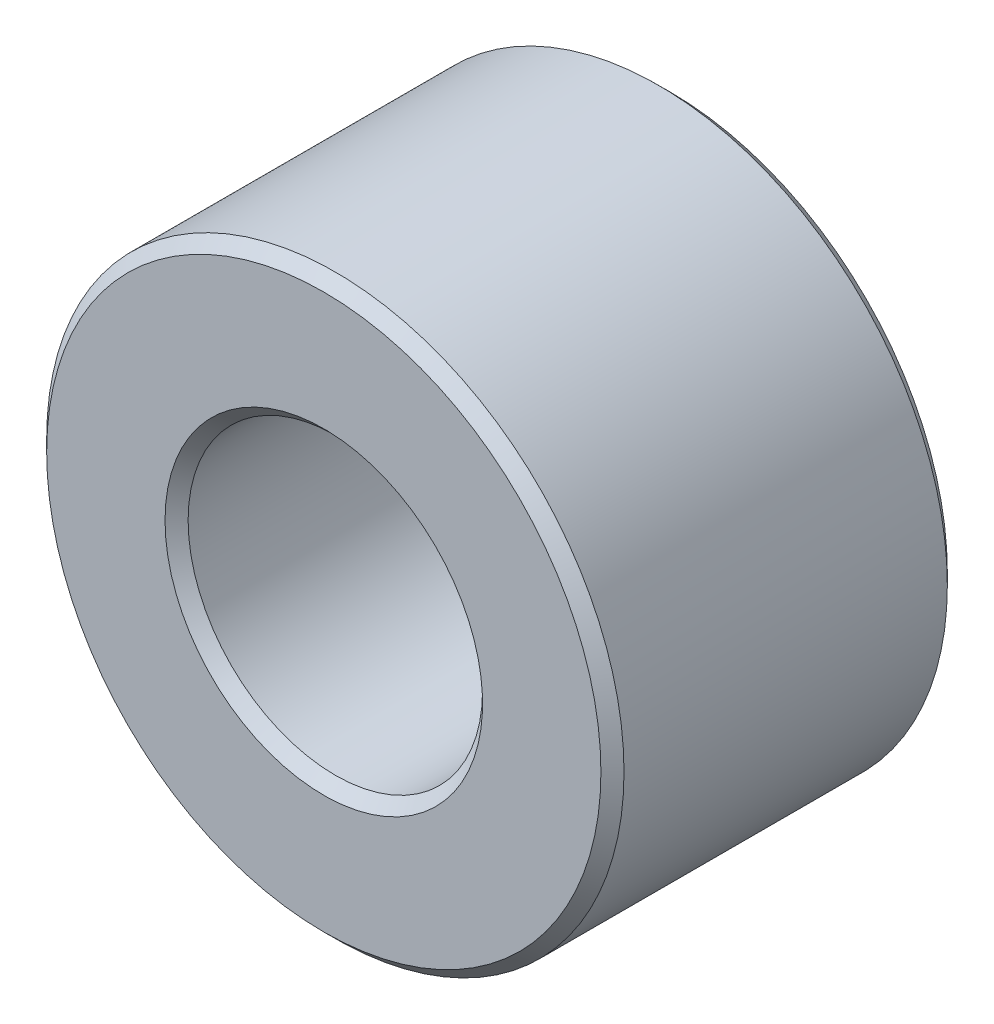
ISO-10303-21;
HEADER;
FILE_DESCRIPTION(('STEP AP214'),'2;1');
FILE_NAME('part.step','',(''),(''),'','','');
FILE_SCHEMA(('AUTOMOTIVE_DESIGN { 1 0 10303 214 1 1 1 1 }'));
ENDSEC;
DATA;
#1=APPLICATION_CONTEXT('core data for automotive mechanical design processes');
#2=APPLICATION_PROTOCOL_DEFINITION('international standard','automotive_design',2000,#1);
#3=PRODUCT_CONTEXT('',#1,'mechanical');
#4=PRODUCT('Part','Part','',(#3));
#5=PRODUCT_RELATED_PRODUCT_CATEGORY('part','',(#4));
#6=PRODUCT_DEFINITION_FORMATION('','',#4);
#7=PRODUCT_DEFINITION_CONTEXT('part definition',#1,'design');
#8=PRODUCT_DEFINITION('design','',#6,#7);
#9=PRODUCT_DEFINITION_SHAPE('','',#8);
#10=(LENGTH_UNIT() NAMED_UNIT(*) SI_UNIT(.MILLI.,.METRE.));
#11=(NAMED_UNIT(*) PLANE_ANGLE_UNIT() SI_UNIT($,.RADIAN.));
#12=(NAMED_UNIT(*) SI_UNIT($,.STERADIAN.) SOLID_ANGLE_UNIT());
#13=UNCERTAINTY_MEASURE_WITH_UNIT(LENGTH_MEASURE(1.E-05),#10,'distance_accuracy_value','');
#14=(GEOMETRIC_REPRESENTATION_CONTEXT(3) GLOBAL_UNCERTAINTY_ASSIGNED_CONTEXT((#13)) GLOBAL_UNIT_ASSIGNED_CONTEXT((#10,
#11,#12)) REPRESENTATION_CONTEXT('',''));
#15=CARTESIAN_POINT('',(0.,0.,0.));
#16=DIRECTION('',(0.,0.,1.));
#17=DIRECTION('',(1.,0.,0.));
#18=AXIS2_PLACEMENT_3D('',#15,#16,#17);
#19=CARTESIAN_POINT('',(4.79999999993197,0.,5.99999999997181));
#20=DIRECTION('',(0.,0.,1.));
#21=DIRECTION('',(1.,0.,0.));
#22=AXIS2_PLACEMENT_3D('',#19,#20,#21);
#23=PLANE('',#22);
#24=CARTESIAN_POINT('',(0.,0.,5.99999999997181));
#25=DIRECTION('',(0.,0.,-1.));
#26=DIRECTION('',(-1.,0.,0.));
#27=AXIS2_PLACEMENT_3D('',#24,#25,#26);
#28=CIRCLE('',#27,2.74999999993497);
#29=CARTESIAN_POINT('',(-2.74999999993497,0.,5.99999999997181));
#30=VERTEX_POINT('',#29);
#31=EDGE_CURVE('E12',#30,#30,#28,.T.);
#32=ORIENTED_EDGE('',*,*,#31,.T.);
#33=EDGE_LOOP('',(#32));
#34=FACE_BOUND('',#33,.T.);
#35=CARTESIAN_POINT('',(0.,0.,5.99999999997181));
#36=DIRECTION('',(0.,0.,-1.));
#37=DIRECTION('',(-1.,0.,0.));
#38=AXIS2_PLACEMENT_3D('',#35,#36,#37);
#39=CIRCLE('',#38,4.79999999993197);
#40=CARTESIAN_POINT('',(-4.79999999993197,0.,5.99999999997181));
#41=VERTEX_POINT('',#40);
#42=EDGE_CURVE('E68',#41,#41,#39,.T.);
#43=ORIENTED_EDGE('',*,*,#42,.F.);
#44=EDGE_LOOP('',(#43));
#45=FACE_BOUND('',#44,.T.);
#46=ADVANCED_FACE('F40',(#34,#45),#23,.T.);
#47=CARTESIAN_POINT('',(0.,0.,5.99999999997181));
#48=DIRECTION('',(0.,0.,1.));
#49=DIRECTION('',(1.,0.,0.));
#50=AXIS2_PLACEMENT_3D('',#47,#48,#49);
#51=CONICAL_SURFACE('',#50,2.74999999993497,0.785398163397447);
#52=CARTESIAN_POINT('',(0.,0.,5.80000000002201));
#53=DIRECTION('',(0.,0.,-1.));
#54=DIRECTION('',(-1.,0.,0.));
#55=AXIS2_PLACEMENT_3D('',#52,#53,#54);
#56=CIRCLE('',#55,2.54999999998518);
#57=CARTESIAN_POINT('',(-2.54999999998518,0.,5.80000000002201));
#58=VERTEX_POINT('',#57);
#59=EDGE_CURVE('E46',#58,#58,#56,.T.);
#60=ORIENTED_EDGE('',*,*,#59,.T.);
#61=EDGE_LOOP('',(#60));
#62=FACE_BOUND('',#61,.T.);
#63=ORIENTED_EDGE('',*,*,#31,.F.);
#64=EDGE_LOOP('',(#63));
#65=FACE_BOUND('',#64,.T.);
#66=ADVANCED_FACE('F76',(#62,#65),#51,.F.);
#67=CARTESIAN_POINT('',(0.,0.,5.99999999997181));
#68=DIRECTION('',(0.,0.,-1.));
#69=DIRECTION('',(-1.,0.,0.));
#70=AXIS2_PLACEMENT_3D('',#67,#68,#69);
#71=CYLINDRICAL_SURFACE('',#70,2.54999999998518);
#72=CARTESIAN_POINT('',(0.,0.,0.200000000006639));
#73=DIRECTION('',(0.,0.,-1.));
#74=DIRECTION('',(-1.,0.,0.));
#75=AXIS2_PLACEMENT_3D('',#72,#73,#74);
#76=CIRCLE('',#75,2.54999999998518);
#77=CARTESIAN_POINT('',(-2.54999999998518,0.,0.200000000006639));
#78=VERTEX_POINT('',#77);
#79=EDGE_CURVE('E50',#78,#78,#76,.T.);
#80=ORIENTED_EDGE('',*,*,#79,.T.);
#81=EDGE_LOOP('',(#80));
#82=FACE_BOUND('',#81,.T.);
#83=ORIENTED_EDGE('',*,*,#59,.F.);
#84=EDGE_LOOP('',(#83));
#85=FACE_BOUND('',#84,.T.);
#86=ADVANCED_FACE('F80',(#82,#85),#71,.F.);
#87=CARTESIAN_POINT('',(0.,0.,0.200000000006639));
#88=DIRECTION('',(0.,0.,-1.));
#89=DIRECTION('',(-1.,0.,0.));
#90=AXIS2_PLACEMENT_3D('',#87,#88,#89);
#91=CONICAL_SURFACE('',#90,2.54999999998518,0.785398163397448);
#92=CARTESIAN_POINT('',(0.,0.,5.6843418860808E-11));
#93=DIRECTION('',(0.,0.,-1.));
#94=DIRECTION('',(-1.,0.,0.));
#95=AXIS2_PLACEMENT_3D('',#92,#93,#94);
#96=CIRCLE('',#95,2.74999999993497);
#97=CARTESIAN_POINT('',(-2.74999999993497,0.,5.6843418860808E-11));
#98=VERTEX_POINT('',#97);
#99=EDGE_CURVE('E54',#98,#98,#96,.T.);
#100=ORIENTED_EDGE('',*,*,#99,.T.);
#101=EDGE_LOOP('',(#100));
#102=FACE_BOUND('',#101,.T.);
#103=ORIENTED_EDGE('',*,*,#79,.F.);
#104=EDGE_LOOP('',(#103));
#105=FACE_BOUND('',#104,.T.);
#106=ADVANCED_FACE('F84',(#102,#105),#91,.F.);
#107=CARTESIAN_POINT('',(2.74999999993497,0.,5.6843418860808E-11));
#108=DIRECTION('',(0.,0.,-1.));
#109=DIRECTION('',(-1.,0.,0.));
#110=AXIS2_PLACEMENT_3D('',#107,#108,#109);
#111=PLANE('',#110);
#112=CARTESIAN_POINT('',(0.,0.,5.6843418860808E-11));
#113=DIRECTION('',(0.,0.,-1.));
#114=DIRECTION('',(-1.,0.,0.));
#115=AXIS2_PLACEMENT_3D('',#112,#113,#114);
#116=CIRCLE('',#115,4.79999999998881);
#117=CARTESIAN_POINT('',(-4.79999999998881,0.,5.6843418860808E-11));
#118=VERTEX_POINT('',#117);
#119=EDGE_CURVE('E59',#118,#118,#116,.T.);
#120=ORIENTED_EDGE('',*,*,#119,.T.);
#121=EDGE_LOOP('',(#120));
#122=FACE_BOUND('',#121,.T.);
#123=ORIENTED_EDGE('',*,*,#99,.F.);
#124=EDGE_LOOP('',(#123));
#125=FACE_BOUND('',#124,.T.);
#126=ADVANCED_FACE('F91',(#122,#125),#111,.T.);
#127=CARTESIAN_POINT('',(0.,0.,5.6843418860808E-11));
#128=DIRECTION('',(0.,0.,1.));
#129=DIRECTION('',(1.,0.,0.));
#130=AXIS2_PLACEMENT_3D('',#127,#128,#129);
#131=CONICAL_SURFACE('',#130,4.79999999998881,0.785398163397448);
#132=CARTESIAN_POINT('',(0.,0.,0.200000000062428));
#133=DIRECTION('',(0.,0.,-1.));
#134=DIRECTION('',(-1.,0.,0.));
#135=AXIS2_PLACEMENT_3D('',#132,#133,#134);
#136=CIRCLE('',#135,4.99999999999441);
#137=CARTESIAN_POINT('',(-4.99999999999441,0.,0.200000000062428));
#138=VERTEX_POINT('',#137);
#139=EDGE_CURVE('E62',#138,#138,#136,.T.);
#140=ORIENTED_EDGE('',*,*,#139,.T.);
#141=EDGE_LOOP('',(#140));
#142=FACE_BOUND('',#141,.T.);
#143=ORIENTED_EDGE('',*,*,#119,.F.);
#144=EDGE_LOOP('',(#143));
#145=FACE_BOUND('',#144,.T.);
#146=ADVANCED_FACE('F95',(#142,#145),#131,.T.);
#147=CARTESIAN_POINT('',(0.,0.,5.99999999997181));
#148=DIRECTION('',(0.,0.,-1.));
#149=DIRECTION('',(-1.,0.,0.));
#150=AXIS2_PLACEMENT_3D('',#147,#148,#149);
#151=CYLINDRICAL_SURFACE('',#150,4.99999999999441);
#152=CARTESIAN_POINT('',(0.,0.,5.80000000006245));
#153=DIRECTION('',(0.,0.,-1.));
#154=DIRECTION('',(-1.,0.,0.));
#155=AXIS2_PLACEMENT_3D('',#152,#153,#154);
#156=CIRCLE('',#155,4.99999999999441);
#157=CARTESIAN_POINT('',(-4.99999999999441,0.,5.80000000006245));
#158=VERTEX_POINT('',#157);
#159=EDGE_CURVE('E65',#158,#158,#156,.T.);
#160=ORIENTED_EDGE('',*,*,#159,.T.);
#161=EDGE_LOOP('',(#160));
#162=FACE_BOUND('',#161,.T.);
#163=ORIENTED_EDGE('',*,*,#139,.F.);
#164=EDGE_LOOP('',(#163));
#165=FACE_BOUND('',#164,.T.);
#166=ADVANCED_FACE('F99',(#162,#165),#151,.T.);
#167=CARTESIAN_POINT('',(0.,0.,5.80000000006245));
#168=DIRECTION('',(0.,0.,-1.));
#169=DIRECTION('',(-1.,0.,0.));
#170=AXIS2_PLACEMENT_3D('',#167,#168,#169);
#171=CONICAL_SURFACE('',#170,4.99999999999441,0.785398163780118);
#172=ORIENTED_EDGE('',*,*,#42,.T.);
#173=EDGE_LOOP('',(#172));
#174=FACE_BOUND('',#173,.T.);
#175=ORIENTED_EDGE('',*,*,#159,.F.);
#176=EDGE_LOOP('',(#175));
#177=FACE_BOUND('',#176,.T.);
#178=ADVANCED_FACE('F72',(#174,#177),#171,.T.);
#179=CLOSED_SHELL('',(#46,#66,#86,#106,#126,#146,#166,#178));
#180=MANIFOLD_SOLID_BREP('B2',#179);
#181=ADVANCED_BREP_SHAPE_REPRESENTATION('',(#18,#180),#14);
#182=SHAPE_DEFINITION_REPRESENTATION(#9,#181);
ENDSEC;
END-ISO-10303-21;
